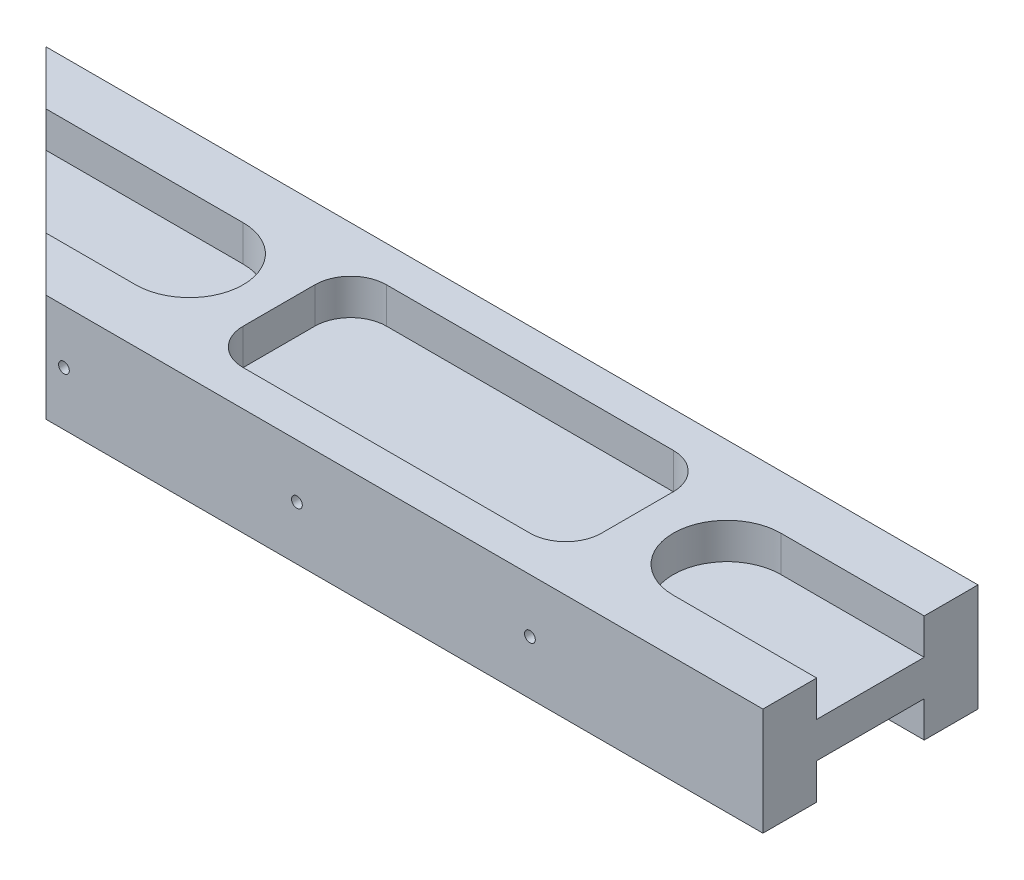
ISO-10303-21;
HEADER;
FILE_DESCRIPTION(('STEP AP214'),'2;1');
FILE_NAME('part.step','',(''),(''),'','','');
FILE_SCHEMA(('AUTOMOTIVE_DESIGN { 1 0 10303 214 1 1 1 1 }'));
ENDSEC;
DATA;
#1=APPLICATION_CONTEXT('core data for automotive mechanical design processes');
#2=APPLICATION_PROTOCOL_DEFINITION('international standard','automotive_design',2000,#1);
#3=PRODUCT_CONTEXT('',#1,'mechanical');
#4=PRODUCT('Part','Part','',(#3));
#5=PRODUCT_RELATED_PRODUCT_CATEGORY('part','',(#4));
#6=PRODUCT_DEFINITION_FORMATION('','',#4);
#7=PRODUCT_DEFINITION_CONTEXT('part definition',#1,'design');
#8=PRODUCT_DEFINITION('design','',#6,#7);
#9=PRODUCT_DEFINITION_SHAPE('','',#8);
#10=(LENGTH_UNIT() NAMED_UNIT(*) SI_UNIT(.MILLI.,.METRE.));
#11=(NAMED_UNIT(*) PLANE_ANGLE_UNIT() SI_UNIT($,.RADIAN.));
#12=(NAMED_UNIT(*) SI_UNIT($,.STERADIAN.) SOLID_ANGLE_UNIT());
#13=UNCERTAINTY_MEASURE_WITH_UNIT(LENGTH_MEASURE(1.E-05),#10,'distance_accuracy_value','');
#14=(GEOMETRIC_REPRESENTATION_CONTEXT(3) GLOBAL_UNCERTAINTY_ASSIGNED_CONTEXT((#13)) GLOBAL_UNIT_ASSIGNED_CONTEXT((#10,
#11,#12)) REPRESENTATION_CONTEXT('',''));
#15=CARTESIAN_POINT('',(0.,0.,0.));
#16=DIRECTION('',(0.,0.,1.));
#17=DIRECTION('',(1.,0.,0.));
#18=AXIS2_PLACEMENT_3D('',#15,#16,#17);
#19=CARTESIAN_POINT('',(0.,15.,-30.));
#20=DIRECTION('',(-1.,0.,0.));
#21=DIRECTION('',(0.,0.,1.));
#22=AXIS2_PLACEMENT_3D('',#19,#20,#21);
#23=PLANE('',#22);
#24=DIRECTION('',(0.,0.,-1.));
#25=VECTOR('',#24,1.);
#26=CARTESIAN_POINT('',(0.,0.,-30.));
#27=LINE('',#26,#25);
#28=CARTESIAN_POINT('',(0.,0.,0.));
#29=VERTEX_POINT('',#28);
#30=CARTESIAN_POINT('',(0.,0.,-7.50000000000001));
#31=VERTEX_POINT('',#30);
#32=EDGE_CURVE('E427',#29,#31,#27,.T.);
#33=ORIENTED_EDGE('',*,*,#32,.T.);
#34=DIRECTION('',(0.,-1.,0.));
#35=VECTOR('',#34,1.);
#36=CARTESIAN_POINT('',(0.,5.,-7.50000000000001));
#37=LINE('',#36,#35);
#38=CARTESIAN_POINT('',(0.,5.,-7.50000000000001));
#39=VERTEX_POINT('',#38);
#40=EDGE_CURVE('E334',#39,#31,#37,.T.);
#41=ORIENTED_EDGE('',*,*,#40,.F.);
#42=DIRECTION('',(0.,0.,1.));
#43=VECTOR('',#42,1.);
#44=CARTESIAN_POINT('',(0.,5.,-7.50000000000001));
#45=LINE('',#44,#43);
#46=CARTESIAN_POINT('',(0.,5.,-22.5));
#47=VERTEX_POINT('',#46);
#48=EDGE_CURVE('E319',#47,#39,#45,.T.);
#49=ORIENTED_EDGE('',*,*,#48,.F.);
#50=DIRECTION('',(0.,-1.,0.));
#51=VECTOR('',#50,1.);
#52=CARTESIAN_POINT('',(0.,5.,-22.5));
#53=LINE('',#52,#51);
#54=CARTESIAN_POINT('',(0.,0.,-22.5));
#55=VERTEX_POINT('',#54);
#56=EDGE_CURVE('E336',#47,#55,#53,.T.);
#57=ORIENTED_EDGE('',*,*,#56,.T.);
#58=CARTESIAN_POINT('',(0.,0.,-30.));
#59=VERTEX_POINT('',#58);
#60=EDGE_CURVE('E413',#55,#59,#27,.T.);
#61=ORIENTED_EDGE('',*,*,#60,.T.);
#62=DIRECTION('',(0.,-1.,0.));
#63=VECTOR('',#62,1.);
#64=CARTESIAN_POINT('',(0.,15.,-30.));
#65=LINE('',#64,#63);
#66=CARTESIAN_POINT('',(0.,15.,-30.));
#67=VERTEX_POINT('',#66);
#68=EDGE_CURVE('E446',#67,#59,#65,.T.);
#69=ORIENTED_EDGE('',*,*,#68,.F.);
#70=DIRECTION('',(0.,0.,-1.));
#71=VECTOR('',#70,1.);
#72=CARTESIAN_POINT('',(0.,15.,-30.));
#73=LINE('',#72,#71);
#74=CARTESIAN_POINT('',(0.,15.,-22.5));
#75=VERTEX_POINT('',#74);
#76=EDGE_CURVE('E418',#75,#67,#73,.T.);
#77=ORIENTED_EDGE('',*,*,#76,.F.);
#78=DIRECTION('',(0.,-1.,0.));
#79=VECTOR('',#78,1.);
#80=CARTESIAN_POINT('',(0.,15.,-22.5));
#81=LINE('',#80,#79);
#82=CARTESIAN_POINT('',(0.,10.,-22.5));
#83=VERTEX_POINT('',#82);
#84=EDGE_CURVE('E383',#75,#83,#81,.T.);
#85=ORIENTED_EDGE('',*,*,#84,.T.);
#86=DIRECTION('',(0.,0.,1.));
#87=VECTOR('',#86,1.);
#88=CARTESIAN_POINT('',(0.,10.,-30.));
#89=LINE('',#88,#87);
#90=CARTESIAN_POINT('',(0.,10.,-7.50000000000001));
#91=VERTEX_POINT('',#90);
#92=EDGE_CURVE('E11',#83,#91,#89,.T.);
#93=ORIENTED_EDGE('',*,*,#92,.T.);
#94=DIRECTION('',(0.,1.,0.));
#95=VECTOR('',#94,1.);
#96=CARTESIAN_POINT('',(0.,15.,-7.50000000000001));
#97=LINE('',#96,#95);
#98=CARTESIAN_POINT('',(0.,15.,-7.50000000000001));
#99=VERTEX_POINT('',#98);
#100=EDGE_CURVE('E404',#91,#99,#97,.T.);
#101=ORIENTED_EDGE('',*,*,#100,.T.);
#102=CARTESIAN_POINT('',(0.,15.,0.));
#103=VERTEX_POINT('',#102);
#104=EDGE_CURVE('E414',#103,#99,#73,.T.);
#105=ORIENTED_EDGE('',*,*,#104,.F.);
#106=DIRECTION('',(0.,-1.,0.));
#107=VECTOR('',#106,1.);
#108=CARTESIAN_POINT('',(0.,15.,0.));
#109=LINE('',#108,#107);
#110=EDGE_CURVE('E426',#103,#29,#109,.T.);
#111=ORIENTED_EDGE('',*,*,#110,.T.);
#112=EDGE_LOOP('',(#33,#41,#49,#57,#61,#69,#77,#85,#93,#101,#105,#111));
#113=FACE_BOUND('',#112,.T.);
#114=ADVANCED_FACE('F39',(#113),#23,.F.);
#115=CARTESIAN_POINT('',(-130.,15.,-30.));
#116=DIRECTION('',(0.,0.,1.));
#117=DIRECTION('',(1.,0.,0.));
#118=AXIS2_PLACEMENT_3D('',#115,#116,#117);
#119=PLANE('',#118);
#120=CARTESIAN_POINT('',(-97.5,7.5,-30.));
#121=DIRECTION('',(0.,0.,-1.));
#122=DIRECTION('',(-1.,0.,0.));
#123=AXIS2_PLACEMENT_3D('',#120,#121,#122);
#124=CIRCLE('',#123,0.749999999999999);
#125=CARTESIAN_POINT('',(-98.25,7.5,-30.));
#126=VERTEX_POINT('',#125);
#127=EDGE_CURVE('E298',#126,#126,#124,.T.);
#128=ORIENTED_EDGE('',*,*,#127,.F.);
#129=EDGE_LOOP('',(#128));
#130=FACE_BOUND('',#129,.T.);
#131=CARTESIAN_POINT('',(-32.5,7.5,-30.));
#132=DIRECTION('',(0.,0.,-1.));
#133=DIRECTION('',(-1.,0.,0.));
#134=AXIS2_PLACEMENT_3D('',#131,#132,#133);
#135=CIRCLE('',#134,0.749999999999999);
#136=CARTESIAN_POINT('',(-33.25,7.5,-30.));
#137=VERTEX_POINT('',#136);
#138=EDGE_CURVE('E297',#137,#137,#135,.T.);
#139=ORIENTED_EDGE('',*,*,#138,.F.);
#140=EDGE_LOOP('',(#139));
#141=FACE_BOUND('',#140,.T.);
#142=CARTESIAN_POINT('',(-65.,7.5,-30.));
#143=DIRECTION('',(0.,0.,-1.));
#144=DIRECTION('',(-1.,0.,0.));
#145=AXIS2_PLACEMENT_3D('',#142,#143,#144);
#146=CIRCLE('',#145,0.749999999999999);
#147=CARTESIAN_POINT('',(-65.75,7.5,-30.));
#148=VERTEX_POINT('',#147);
#149=EDGE_CURVE('E301',#148,#148,#146,.T.);
#150=ORIENTED_EDGE('',*,*,#149,.F.);
#151=EDGE_LOOP('',(#150));
#152=FACE_BOUND('',#151,.T.);
#153=DIRECTION('',(-1.,0.,0.));
#154=VECTOR('',#153,1.);
#155=CARTESIAN_POINT('',(-130.,0.,-30.));
#156=LINE('',#155,#154);
#157=CARTESIAN_POINT('',(-130.,0.,-30.));
#158=VERTEX_POINT('',#157);
#159=EDGE_CURVE('E430',#59,#158,#156,.T.);
#160=ORIENTED_EDGE('',*,*,#159,.T.);
#161=DIRECTION('',(0.,-1.,0.));
#162=VECTOR('',#161,1.);
#163=CARTESIAN_POINT('',(-130.,15.,-30.));
#164=LINE('',#163,#162);
#165=CARTESIAN_POINT('',(-130.,15.,-30.));
#166=VERTEX_POINT('',#165);
#167=EDGE_CURVE('E443',#166,#158,#164,.T.);
#168=ORIENTED_EDGE('',*,*,#167,.F.);
#169=DIRECTION('',(-1.,0.,0.));
#170=VECTOR('',#169,1.);
#171=CARTESIAN_POINT('',(-130.,15.,-30.));
#172=LINE('',#171,#170);
#173=EDGE_CURVE('E417',#67,#166,#172,.T.);
#174=ORIENTED_EDGE('',*,*,#173,.F.);
#175=ORIENTED_EDGE('',*,*,#68,.T.);
#176=EDGE_LOOP('',(#160,#168,#174,#175));
#177=FACE_BOUND('',#176,.T.);
#178=ADVANCED_FACE('F483',(#130,#141,#152,#177),#119,.F.);
#179=CARTESIAN_POINT('',(-100.,15.,0.));
#180=DIRECTION('',(0.707106781186547,0.,-0.707106781186547));
#181=DIRECTION('',(-0.707106781186548,0.,-0.707106781186548));
#182=AXIS2_PLACEMENT_3D('',#179,#180,#181);
#183=PLANE('',#182);
#184=DIRECTION('',(0.707106781186547,0.,0.707106781186547));
#185=VECTOR('',#184,1.);
#186=CARTESIAN_POINT('',(-100.,0.,0.));
#187=LINE('',#186,#185);
#188=CARTESIAN_POINT('',(-122.5,0.,-22.5));
#189=VERTEX_POINT('',#188);
#190=EDGE_CURVE('E433',#158,#189,#187,.T.);
#191=ORIENTED_EDGE('',*,*,#190,.T.);
#192=DIRECTION('',(0.,-1.,0.));
#193=VECTOR('',#192,1.);
#194=CARTESIAN_POINT('',(-122.5,5.,-22.5));
#195=LINE('',#194,#193);
#196=CARTESIAN_POINT('',(-122.5,5.,-22.5));
#197=VERTEX_POINT('',#196);
#198=EDGE_CURVE('E347',#197,#189,#195,.T.);
#199=ORIENTED_EDGE('',*,*,#198,.F.);
#200=DIRECTION('',(-0.707106781186547,0.,-0.707106781186547));
#201=VECTOR('',#200,1.);
#202=CARTESIAN_POINT('',(-122.5,5.,-22.5));
#203=LINE('',#202,#201);
#204=CARTESIAN_POINT('',(-107.5,5.,-7.50000000000001));
#205=VERTEX_POINT('',#204);
#206=EDGE_CURVE('E359',#205,#197,#203,.T.);
#207=ORIENTED_EDGE('',*,*,#206,.F.);
#208=DIRECTION('',(0.,-1.,0.));
#209=VECTOR('',#208,1.);
#210=CARTESIAN_POINT('',(-107.5,5.,-7.50000000000001));
#211=LINE('',#210,#209);
#212=CARTESIAN_POINT('',(-107.5,0.,-7.50000000000001));
#213=VERTEX_POINT('',#212);
#214=EDGE_CURVE('E344',#205,#213,#211,.T.);
#215=ORIENTED_EDGE('',*,*,#214,.T.);
#216=CARTESIAN_POINT('',(-100.,0.,0.));
#217=VERTEX_POINT('',#216);
#218=EDGE_CURVE('E432',#213,#217,#187,.T.);
#219=ORIENTED_EDGE('',*,*,#218,.T.);
#220=DIRECTION('',(0.,-1.,0.));
#221=VECTOR('',#220,1.);
#222=CARTESIAN_POINT('',(-100.,15.,0.));
#223=LINE('',#222,#221);
#224=CARTESIAN_POINT('',(-100.,15.,0.));
#225=VERTEX_POINT('',#224);
#226=EDGE_CURVE('E440',#225,#217,#223,.T.);
#227=ORIENTED_EDGE('',*,*,#226,.F.);
#228=DIRECTION('',(0.707106781186547,0.,0.707106781186547));
#229=VECTOR('',#228,1.);
#230=CARTESIAN_POINT('',(-100.,15.,0.));
#231=LINE('',#230,#229);
#232=CARTESIAN_POINT('',(-107.5,15.,-7.50000000000001));
#233=VERTEX_POINT('',#232);
#234=EDGE_CURVE('E420',#233,#225,#231,.T.);
#235=ORIENTED_EDGE('',*,*,#234,.F.);
#236=DIRECTION('',(0.,-1.,0.));
#237=VECTOR('',#236,1.);
#238=CARTESIAN_POINT('',(-107.5,15.,-7.50000000000001));
#239=LINE('',#238,#237);
#240=CARTESIAN_POINT('',(-107.5,10.,-7.50000000000001));
#241=VERTEX_POINT('',#240);
#242=EDGE_CURVE('E407',#233,#241,#239,.T.);
#243=ORIENTED_EDGE('',*,*,#242,.T.);
#244=DIRECTION('',(0.707106781186548,0.,0.707106781186548));
#245=VECTOR('',#244,1.);
#246=CARTESIAN_POINT('',(-100.,10.,0.));
#247=LINE('',#246,#245);
#248=CARTESIAN_POINT('',(-122.5,10.,-22.5));
#249=VERTEX_POINT('',#248);
#250=EDGE_CURVE('E46',#249,#241,#247,.T.);
#251=ORIENTED_EDGE('',*,*,#250,.F.);
#252=DIRECTION('',(0.,1.,0.));
#253=VECTOR('',#252,1.);
#254=CARTESIAN_POINT('',(-122.5,15.,-22.5));
#255=LINE('',#254,#253);
#256=CARTESIAN_POINT('',(-122.5,15.,-22.5));
#257=VERTEX_POINT('',#256);
#258=EDGE_CURVE('E410',#249,#257,#255,.T.);
#259=ORIENTED_EDGE('',*,*,#258,.T.);
#260=EDGE_CURVE('E421',#166,#257,#231,.T.);
#261=ORIENTED_EDGE('',*,*,#260,.F.);
#262=ORIENTED_EDGE('',*,*,#167,.T.);
#263=EDGE_LOOP('',(#191,#199,#207,#215,#219,#227,#235,#243,#251,#259,#261,#262));
#264=FACE_BOUND('',#263,.T.);
#265=ADVANCED_FACE('F465',(#264),#183,.F.);
#266=CARTESIAN_POINT('',(0.,15.,0.));
#267=DIRECTION('',(0.,0.,-1.));
#268=DIRECTION('',(-1.,0.,0.));
#269=AXIS2_PLACEMENT_3D('',#266,#267,#268);
#270=PLANE('',#269);
#271=CARTESIAN_POINT('',(-97.5,7.5,0.));
#272=DIRECTION('',(0.,0.,-1.));
#273=DIRECTION('',(-1.,0.,0.));
#274=AXIS2_PLACEMENT_3D('',#271,#272,#273);
#275=CIRCLE('',#274,0.749999999999999);
#276=CARTESIAN_POINT('',(-98.25,7.5,0.));
#277=VERTEX_POINT('',#276);
#278=EDGE_CURVE('E282',#277,#277,#275,.F.);
#279=ORIENTED_EDGE('',*,*,#278,.F.);
#280=EDGE_LOOP('',(#279));
#281=FACE_BOUND('',#280,.T.);
#282=CARTESIAN_POINT('',(-32.5,7.5,0.));
#283=DIRECTION('',(0.,0.,-1.));
#284=DIRECTION('',(-1.,0.,0.));
#285=AXIS2_PLACEMENT_3D('',#282,#283,#284);
#286=CIRCLE('',#285,0.749999999999999);
#287=CARTESIAN_POINT('',(-33.25,7.5,0.));
#288=VERTEX_POINT('',#287);
#289=EDGE_CURVE('E294',#288,#288,#286,.F.);
#290=ORIENTED_EDGE('',*,*,#289,.F.);
#291=EDGE_LOOP('',(#290));
#292=FACE_BOUND('',#291,.T.);
#293=CARTESIAN_POINT('',(-65.,7.5,0.));
#294=DIRECTION('',(0.,0.,-1.));
#295=DIRECTION('',(-1.,0.,0.));
#296=AXIS2_PLACEMENT_3D('',#293,#294,#295);
#297=CIRCLE('',#296,0.749999999999999);
#298=CARTESIAN_POINT('',(-65.75,7.5,0.));
#299=VERTEX_POINT('',#298);
#300=EDGE_CURVE('E308',#299,#299,#297,.F.);
#301=ORIENTED_EDGE('',*,*,#300,.F.);
#302=EDGE_LOOP('',(#301));
#303=FACE_BOUND('',#302,.T.);
#304=DIRECTION('',(1.,0.,0.));
#305=VECTOR('',#304,1.);
#306=CARTESIAN_POINT('',(0.,0.,0.));
#307=LINE('',#306,#305);
#308=EDGE_CURVE('E436',#217,#29,#307,.T.);
#309=ORIENTED_EDGE('',*,*,#308,.T.);
#310=ORIENTED_EDGE('',*,*,#110,.F.);
#311=DIRECTION('',(1.,0.,0.));
#312=VECTOR('',#311,1.);
#313=CARTESIAN_POINT('',(0.,15.,0.));
#314=LINE('',#313,#312);
#315=EDGE_CURVE('E424',#225,#103,#314,.T.);
#316=ORIENTED_EDGE('',*,*,#315,.F.);
#317=ORIENTED_EDGE('',*,*,#226,.T.);
#318=EDGE_LOOP('',(#309,#310,#316,#317));
#319=FACE_BOUND('',#318,.T.);
#320=ADVANCED_FACE('F508',(#281,#292,#303,#319),#270,.F.);
#321=CARTESIAN_POINT('',(0.,15.,0.));
#322=DIRECTION('',(0.,-1.,0.));
#323=DIRECTION('',(0.,0.,-1.));
#324=AXIS2_PLACEMENT_3D('',#321,#322,#323);
#325=PLANE('',#324);
#326=DIRECTION('',(-1.,0.,0.));
#327=VECTOR('',#326,1.);
#328=CARTESIAN_POINT('',(-77.5,15.,-25.));
#329=LINE('',#328,#327);
#330=CARTESIAN_POINT('',(-37.5,15.,-25.));
#331=VERTEX_POINT('',#330);
#332=CARTESIAN_POINT('',(-77.5,15.,-25.));
#333=VERTEX_POINT('',#332);
#334=EDGE_CURVE('E264',#331,#333,#329,.T.);
#335=ORIENTED_EDGE('',*,*,#334,.F.);
#336=CARTESIAN_POINT('',(-37.5,15.,-20.));
#337=DIRECTION('',(0.,1.,0.));
#338=DIRECTION('',(0.,0.,-1.));
#339=AXIS2_PLACEMENT_3D('',#336,#337,#338);
#340=CIRCLE('',#339,5.);
#341=CARTESIAN_POINT('',(-32.5,15.,-20.));
#342=VERTEX_POINT('',#341);
#343=EDGE_CURVE('E53',#342,#331,#340,.T.);
#344=ORIENTED_EDGE('',*,*,#343,.F.);
#345=DIRECTION('',(0.,0.,-1.));
#346=VECTOR('',#345,1.);
#347=CARTESIAN_POINT('',(-32.5,15.,-20.));
#348=LINE('',#347,#346);
#349=CARTESIAN_POINT('',(-32.5,15.,-10.));
#350=VERTEX_POINT('',#349);
#351=EDGE_CURVE('E244',#350,#342,#348,.T.);
#352=ORIENTED_EDGE('',*,*,#351,.F.);
#353=CARTESIAN_POINT('',(-37.5,15.,-10.));
#354=DIRECTION('',(0.,1.,0.));
#355=DIRECTION('',(0.,0.,1.));
#356=AXIS2_PLACEMENT_3D('',#353,#354,#355);
#357=CIRCLE('',#356,5.);
#358=CARTESIAN_POINT('',(-37.5,15.,-5.));
#359=VERTEX_POINT('',#358);
#360=EDGE_CURVE('E247',#359,#350,#357,.T.);
#361=ORIENTED_EDGE('',*,*,#360,.F.);
#362=DIRECTION('',(1.,0.,0.));
#363=VECTOR('',#362,1.);
#364=CARTESIAN_POINT('',(-77.5,15.,-5.));
#365=LINE('',#364,#363);
#366=CARTESIAN_POINT('',(-77.5,15.,-5.));
#367=VERTEX_POINT('',#366);
#368=EDGE_CURVE('E275',#367,#359,#365,.T.);
#369=ORIENTED_EDGE('',*,*,#368,.F.);
#370=CARTESIAN_POINT('',(-77.5,15.,-10.));
#371=DIRECTION('',(0.,1.,0.));
#372=DIRECTION('',(0.,0.,1.));
#373=AXIS2_PLACEMENT_3D('',#370,#371,#372);
#374=CIRCLE('',#373,5.);
#375=CARTESIAN_POINT('',(-82.5,15.,-10.));
#376=VERTEX_POINT('',#375);
#377=EDGE_CURVE('E272',#376,#367,#374,.T.);
#378=ORIENTED_EDGE('',*,*,#377,.F.);
#379=DIRECTION('',(0.,0.,1.));
#380=VECTOR('',#379,1.);
#381=CARTESIAN_POINT('',(-82.5,15.,-20.));
#382=LINE('',#381,#380);
#383=CARTESIAN_POINT('',(-82.5,15.,-20.));
#384=VERTEX_POINT('',#383);
#385=EDGE_CURVE('E269',#384,#376,#382,.T.);
#386=ORIENTED_EDGE('',*,*,#385,.F.);
#387=CARTESIAN_POINT('',(-77.5,15.,-20.));
#388=DIRECTION('',(0.,1.,0.));
#389=DIRECTION('',(0.,0.,1.));
#390=AXIS2_PLACEMENT_3D('',#387,#388,#389);
#391=CIRCLE('',#390,5.);
#392=EDGE_CURVE('E266',#333,#384,#391,.T.);
#393=ORIENTED_EDGE('',*,*,#392,.F.);
#394=EDGE_LOOP('',(#335,#344,#352,#361,#369,#378,#386,#393));
#395=FACE_BOUND('',#394,.T.);
#396=ORIENTED_EDGE('',*,*,#260,.T.);
#397=DIRECTION('',(-1.,0.,0.));
#398=VECTOR('',#397,1.);
#399=CARTESIAN_POINT('',(-135.,15.,-22.5));
#400=LINE('',#399,#398);
#401=CARTESIAN_POINT('',(-95.,15.,-22.5));
#402=VERTEX_POINT('',#401);
#403=EDGE_CURVE('E369',#402,#257,#400,.T.);
#404=ORIENTED_EDGE('',*,*,#403,.F.);
#405=CARTESIAN_POINT('',(-95.,15.,-15.));
#406=DIRECTION('',(0.,1.,0.));
#407=DIRECTION('',(0.,0.,1.));
#408=AXIS2_PLACEMENT_3D('',#405,#406,#407);
#409=CIRCLE('',#408,7.5);
#410=CARTESIAN_POINT('',(-95.,15.,-7.50000000000001));
#411=VERTEX_POINT('',#410);
#412=EDGE_CURVE('E376',#411,#402,#409,.T.);
#413=ORIENTED_EDGE('',*,*,#412,.F.);
#414=DIRECTION('',(-1.,0.,0.));
#415=VECTOR('',#414,1.);
#416=CARTESIAN_POINT('',(0.,15.,-7.50000000000002));
#417=LINE('',#416,#415);
#418=EDGE_CURVE('E452',#411,#233,#417,.T.);
#419=ORIENTED_EDGE('',*,*,#418,.T.);
#420=ORIENTED_EDGE('',*,*,#234,.T.);
#421=ORIENTED_EDGE('',*,*,#315,.T.);
#422=ORIENTED_EDGE('',*,*,#104,.T.);
#423=DIRECTION('',(1.,0.,0.));
#424=VECTOR('',#423,1.);
#425=CARTESIAN_POINT('',(20.,15.,-7.5));
#426=LINE('',#425,#424);
#427=CARTESIAN_POINT('',(-20.,15.,-7.50000000000001));
#428=VERTEX_POINT('',#427);
#429=EDGE_CURVE('E391',#428,#99,#426,.T.);
#430=ORIENTED_EDGE('',*,*,#429,.F.);
#431=CARTESIAN_POINT('',(-20.,15.,-15.));
#432=DIRECTION('',(0.,1.,0.));
#433=DIRECTION('',(0.,0.,-1.));
#434=AXIS2_PLACEMENT_3D('',#431,#432,#433);
#435=CIRCLE('',#434,7.5);
#436=CARTESIAN_POINT('',(-20.,15.,-22.5));
#437=VERTEX_POINT('',#436);
#438=EDGE_CURVE('E379',#437,#428,#435,.T.);
#439=ORIENTED_EDGE('',*,*,#438,.F.);
#440=DIRECTION('',(1.,0.,0.));
#441=VECTOR('',#440,1.);
#442=CARTESIAN_POINT('',(0.,15.,-22.5));
#443=LINE('',#442,#441);
#444=EDGE_CURVE('E449',#437,#75,#443,.T.);
#445=ORIENTED_EDGE('',*,*,#444,.T.);
#446=ORIENTED_EDGE('',*,*,#76,.T.);
#447=ORIENTED_EDGE('',*,*,#173,.T.);
#448=EDGE_LOOP('',(#396,#404,#413,#419,#420,#421,#422,#430,#439,#445,#446,#447));
#449=FACE_BOUND('',#448,.T.);
#450=ADVANCED_FACE('F469',(#395,#449),#325,.F.);
#451=CARTESIAN_POINT('',(0.,0.,0.));
#452=DIRECTION('',(0.,-1.,0.));
#453=DIRECTION('',(0.,0.,-1.));
#454=AXIS2_PLACEMENT_3D('',#451,#452,#453);
#455=PLANE('',#454);
#456=DIRECTION('',(-1.,0.,0.));
#457=VECTOR('',#456,1.);
#458=CARTESIAN_POINT('',(-20.,0.,-7.50000000000001));
#459=LINE('',#458,#457);
#460=CARTESIAN_POINT('',(-20.,0.,-7.50000000000001));
#461=VERTEX_POINT('',#460);
#462=EDGE_CURVE('E316',#31,#461,#459,.T.);
#463=ORIENTED_EDGE('',*,*,#462,.F.);
#464=ORIENTED_EDGE('',*,*,#32,.F.);
#465=ORIENTED_EDGE('',*,*,#308,.F.);
#466=ORIENTED_EDGE('',*,*,#218,.F.);
#467=DIRECTION('',(-1.,0.,0.));
#468=VECTOR('',#467,1.);
#469=CARTESIAN_POINT('',(-107.5,0.,-7.50000000000001));
#470=LINE('',#469,#468);
#471=CARTESIAN_POINT('',(-95.,0.,-7.50000000000001));
#472=VERTEX_POINT('',#471);
#473=EDGE_CURVE('E353',#472,#213,#470,.T.);
#474=ORIENTED_EDGE('',*,*,#473,.F.);
#475=CARTESIAN_POINT('',(-95.,0.,-15.));
#476=DIRECTION('',(0.,-1.,0.));
#477=DIRECTION('',(0.,0.,-1.));
#478=AXIS2_PLACEMENT_3D('',#475,#476,#477);
#479=CIRCLE('',#478,7.5);
#480=CARTESIAN_POINT('',(-95.,0.,-22.5));
#481=VERTEX_POINT('',#480);
#482=EDGE_CURVE('E327',#481,#472,#479,.T.);
#483=ORIENTED_EDGE('',*,*,#482,.F.);
#484=DIRECTION('',(1.,0.,0.));
#485=VECTOR('',#484,1.);
#486=CARTESIAN_POINT('',(-95.,0.,-22.5));
#487=LINE('',#486,#485);
#488=EDGE_CURVE('E350',#189,#481,#487,.T.);
#489=ORIENTED_EDGE('',*,*,#488,.F.);
#490=ORIENTED_EDGE('',*,*,#190,.F.);
#491=ORIENTED_EDGE('',*,*,#159,.F.);
#492=ORIENTED_EDGE('',*,*,#60,.F.);
#493=DIRECTION('',(1.,0.,0.));
#494=VECTOR('',#493,1.);
#495=CARTESIAN_POINT('',(0.,0.,-22.5));
#496=LINE('',#495,#494);
#497=CARTESIAN_POINT('',(-20.,0.,-22.5));
#498=VERTEX_POINT('',#497);
#499=EDGE_CURVE('E326',#498,#55,#496,.T.);
#500=ORIENTED_EDGE('',*,*,#499,.F.);
#501=CARTESIAN_POINT('',(-20.,0.,-15.));
#502=DIRECTION('',(0.,-1.,0.));
#503=DIRECTION('',(0.,0.,-1.));
#504=AXIS2_PLACEMENT_3D('',#501,#502,#503);
#505=CIRCLE('',#504,7.5);
#506=EDGE_CURVE('E61',#461,#498,#505,.T.);
#507=ORIENTED_EDGE('',*,*,#506,.F.);
#508=EDGE_LOOP('',(#463,#464,#465,#466,#474,#483,#489,#490,#491,#492,#500,#507));
#509=FACE_BOUND('',#508,.T.);
#510=ADVANCED_FACE('F490',(#509),#455,.T.);
#511=CARTESIAN_POINT('',(20.,10.,-15.));
#512=DIRECTION('',(0.,-1.,0.));
#513=DIRECTION('',(0.,0.,-1.));
#514=AXIS2_PLACEMENT_3D('',#511,#512,#513);
#515=PLANE('',#514);
#516=DIRECTION('',(-1.,0.,0.));
#517=VECTOR('',#516,1.);
#518=CARTESIAN_POINT('',(20.,10.,-22.5));
#519=LINE('',#518,#517);
#520=CARTESIAN_POINT('',(-20.,10.,-22.5));
#521=VERTEX_POINT('',#520);
#522=EDGE_CURVE('E393',#83,#521,#519,.T.);
#523=ORIENTED_EDGE('',*,*,#522,.T.);
#524=CARTESIAN_POINT('',(-20.,10.,-15.));
#525=DIRECTION('',(0.,1.,0.));
#526=DIRECTION('',(0.,0.,-1.));
#527=AXIS2_PLACEMENT_3D('',#524,#525,#526);
#528=CIRCLE('',#527,7.5);
#529=CARTESIAN_POINT('',(-20.,10.,-7.50000000000001));
#530=VERTEX_POINT('',#529);
#531=EDGE_CURVE('E398',#521,#530,#528,.T.);
#532=ORIENTED_EDGE('',*,*,#531,.T.);
#533=DIRECTION('',(1.,0.,0.));
#534=VECTOR('',#533,1.);
#535=CARTESIAN_POINT('',(20.,10.,-7.5));
#536=LINE('',#535,#534);
#537=EDGE_CURVE('E389',#530,#91,#536,.T.);
#538=ORIENTED_EDGE('',*,*,#537,.T.);
#539=ORIENTED_EDGE('',*,*,#92,.F.);
#540=EDGE_LOOP('',(#523,#532,#538,#539));
#541=FACE_BOUND('',#540,.T.);
#542=ADVANCED_FACE('F564',(#541),#515,.F.);
#543=CARTESIAN_POINT('',(20.,10.,-7.5));
#544=DIRECTION('',(0.,0.,1.));
#545=DIRECTION('',(1.,0.,0.));
#546=AXIS2_PLACEMENT_3D('',#543,#544,#545);
#547=PLANE('',#546);
#548=ORIENTED_EDGE('',*,*,#537,.F.);
#549=DIRECTION('',(0.,1.,0.));
#550=VECTOR('',#549,1.);
#551=CARTESIAN_POINT('',(-20.,10.,-7.50000000000001));
#552=LINE('',#551,#550);
#553=EDGE_CURVE('E333',#530,#428,#552,.T.);
#554=ORIENTED_EDGE('',*,*,#553,.T.);
#555=ORIENTED_EDGE('',*,*,#429,.T.);
#556=ORIENTED_EDGE('',*,*,#100,.F.);
#557=EDGE_LOOP('',(#548,#554,#555,#556));
#558=FACE_BOUND('',#557,.T.);
#559=ADVANCED_FACE('F515',(#558),#547,.F.);
#560=CARTESIAN_POINT('',(20.,10.,-22.5));
#561=DIRECTION('',(0.,0.,-1.));
#562=DIRECTION('',(-1.,0.,0.));
#563=AXIS2_PLACEMENT_3D('',#560,#561,#562);
#564=PLANE('',#563);
#565=ORIENTED_EDGE('',*,*,#444,.F.);
#566=DIRECTION('',(0.,1.,0.));
#567=VECTOR('',#566,1.);
#568=CARTESIAN_POINT('',(-20.,10.,-22.5));
#569=LINE('',#568,#567);
#570=EDGE_CURVE('E386',#521,#437,#569,.T.);
#571=ORIENTED_EDGE('',*,*,#570,.F.);
#572=ORIENTED_EDGE('',*,*,#522,.F.);
#573=ORIENTED_EDGE('',*,*,#84,.F.);
#574=EDGE_LOOP('',(#565,#571,#572,#573));
#575=FACE_BOUND('',#574,.T.);
#576=ADVANCED_FACE('F522',(#575),#564,.F.);
#577=CARTESIAN_POINT('',(-20.,10.,-15.));
#578=DIRECTION('',(0.,1.,0.));
#579=DIRECTION('',(0.,0.,1.));
#580=AXIS2_PLACEMENT_3D('',#577,#578,#579);
#581=CYLINDRICAL_SURFACE('',#580,7.5);
#582=ORIENTED_EDGE('',*,*,#438,.T.);
#583=ORIENTED_EDGE('',*,*,#553,.F.);
#584=ORIENTED_EDGE('',*,*,#531,.F.);
#585=ORIENTED_EDGE('',*,*,#570,.T.);
#586=EDGE_LOOP('',(#582,#583,#584,#585));
#587=FACE_BOUND('',#586,.T.);
#588=ADVANCED_FACE('F518',(#587),#581,.F.);
#589=CARTESIAN_POINT('',(-135.,10.,-15.));
#590=DIRECTION('',(0.,1.,0.));
#591=DIRECTION('',(0.,0.,1.));
#592=AXIS2_PLACEMENT_3D('',#589,#590,#591);
#593=PLANE('',#592);
#594=ORIENTED_EDGE('',*,*,#250,.T.);
#595=DIRECTION('',(1.,0.,0.));
#596=VECTOR('',#595,1.);
#597=CARTESIAN_POINT('',(-135.,10.,-7.5));
#598=LINE('',#597,#596);
#599=CARTESIAN_POINT('',(-95.,10.,-7.50000000000001));
#600=VERTEX_POINT('',#599);
#601=EDGE_CURVE('E366',#241,#600,#598,.T.);
#602=ORIENTED_EDGE('',*,*,#601,.T.);
#603=CARTESIAN_POINT('',(-95.,10.,-15.));
#604=DIRECTION('',(0.,1.,0.));
#605=DIRECTION('',(0.,0.,1.));
#606=AXIS2_PLACEMENT_3D('',#603,#604,#605);
#607=CIRCLE('',#606,7.5);
#608=CARTESIAN_POINT('',(-95.,10.,-22.5));
#609=VERTEX_POINT('',#608);
#610=EDGE_CURVE('E368',#600,#609,#607,.T.);
#611=ORIENTED_EDGE('',*,*,#610,.T.);
#612=DIRECTION('',(-1.,0.,0.));
#613=VECTOR('',#612,1.);
#614=CARTESIAN_POINT('',(-135.,10.,-22.5));
#615=LINE('',#614,#613);
#616=EDGE_CURVE('E372',#609,#249,#615,.T.);
#617=ORIENTED_EDGE('',*,*,#616,.T.);
#618=EDGE_LOOP('',(#594,#602,#611,#617));
#619=FACE_BOUND('',#618,.T.);
#620=ADVANCED_FACE('F457',(#619),#593,.T.);
#621=CARTESIAN_POINT('',(-135.,10.,-22.5));
#622=DIRECTION('',(0.,0.,-1.));
#623=DIRECTION('',(-1.,0.,0.));
#624=AXIS2_PLACEMENT_3D('',#621,#622,#623);
#625=PLANE('',#624);
#626=ORIENTED_EDGE('',*,*,#616,.F.);
#627=DIRECTION('',(0.,1.,0.));
#628=VECTOR('',#627,1.);
#629=CARTESIAN_POINT('',(-95.,10.,-22.5));
#630=LINE('',#629,#628);
#631=EDGE_CURVE('E381',#609,#402,#630,.T.);
#632=ORIENTED_EDGE('',*,*,#631,.T.);
#633=ORIENTED_EDGE('',*,*,#403,.T.);
#634=ORIENTED_EDGE('',*,*,#258,.F.);
#635=EDGE_LOOP('',(#626,#632,#633,#634));
#636=FACE_BOUND('',#635,.T.);
#637=ADVANCED_FACE('F476',(#636),#625,.F.);
#638=CARTESIAN_POINT('',(-135.,10.,-7.5));
#639=DIRECTION('',(0.,0.,1.));
#640=DIRECTION('',(1.,0.,0.));
#641=AXIS2_PLACEMENT_3D('',#638,#639,#640);
#642=PLANE('',#641);
#643=ORIENTED_EDGE('',*,*,#418,.F.);
#644=DIRECTION('',(0.,1.,0.));
#645=VECTOR('',#644,1.);
#646=CARTESIAN_POINT('',(-95.,10.,-7.50000000000001));
#647=LINE('',#646,#645);
#648=EDGE_CURVE('E375',#600,#411,#647,.T.);
#649=ORIENTED_EDGE('',*,*,#648,.F.);
#650=ORIENTED_EDGE('',*,*,#601,.F.);
#651=ORIENTED_EDGE('',*,*,#242,.F.);
#652=EDGE_LOOP('',(#643,#649,#650,#651));
#653=FACE_BOUND('',#652,.T.);
#654=ADVANCED_FACE('F462',(#653),#642,.F.);
#655=CARTESIAN_POINT('',(-95.,10.,-15.));
#656=DIRECTION('',(0.,1.,0.));
#657=DIRECTION('',(0.,0.,1.));
#658=AXIS2_PLACEMENT_3D('',#655,#656,#657);
#659=CYLINDRICAL_SURFACE('',#658,7.5);
#660=ORIENTED_EDGE('',*,*,#412,.T.);
#661=ORIENTED_EDGE('',*,*,#631,.F.);
#662=ORIENTED_EDGE('',*,*,#610,.F.);
#663=ORIENTED_EDGE('',*,*,#648,.T.);
#664=EDGE_LOOP('',(#660,#661,#662,#663));
#665=FACE_BOUND('',#664,.T.);
#666=ADVANCED_FACE('F474',(#665),#659,.F.);
#667=CARTESIAN_POINT('',(-95.,5.,-15.));
#668=DIRECTION('',(0.,-1.,0.));
#669=DIRECTION('',(0.,0.,-1.));
#670=AXIS2_PLACEMENT_3D('',#667,#668,#669);
#671=CYLINDRICAL_SURFACE('',#670,7.5);
#672=ORIENTED_EDGE('',*,*,#482,.T.);
#673=DIRECTION('',(0.,-1.,0.));
#674=VECTOR('',#673,1.);
#675=CARTESIAN_POINT('',(-95.,5.,-7.50000000000001));
#676=LINE('',#675,#674);
#677=CARTESIAN_POINT('',(-95.,5.,-7.50000000000001));
#678=VERTEX_POINT('',#677);
#679=EDGE_CURVE('E340',#678,#472,#676,.T.);
#680=ORIENTED_EDGE('',*,*,#679,.F.);
#681=CARTESIAN_POINT('',(-95.,5.,-15.));
#682=DIRECTION('',(0.,-1.,0.));
#683=DIRECTION('',(0.,0.,-1.));
#684=AXIS2_PLACEMENT_3D('',#681,#682,#683);
#685=CIRCLE('',#684,7.5);
#686=CARTESIAN_POINT('',(-95.,5.,-22.5));
#687=VERTEX_POINT('',#686);
#688=EDGE_CURVE('E354',#687,#678,#685,.T.);
#689=ORIENTED_EDGE('',*,*,#688,.F.);
#690=DIRECTION('',(0.,-1.,0.));
#691=VECTOR('',#690,1.);
#692=CARTESIAN_POINT('',(-95.,5.,-22.5));
#693=LINE('',#692,#691);
#694=EDGE_CURVE('E311',#687,#481,#693,.T.);
#695=ORIENTED_EDGE('',*,*,#694,.T.);
#696=EDGE_LOOP('',(#672,#680,#689,#695));
#697=FACE_BOUND('',#696,.T.);
#698=ADVANCED_FACE('F580',(#697),#671,.F.);
#699=CARTESIAN_POINT('',(-95.,5.,-22.5));
#700=DIRECTION('',(0.,0.,-1.));
#701=DIRECTION('',(-1.,0.,0.));
#702=AXIS2_PLACEMENT_3D('',#699,#700,#701);
#703=PLANE('',#702);
#704=ORIENTED_EDGE('',*,*,#488,.T.);
#705=ORIENTED_EDGE('',*,*,#694,.F.);
#706=DIRECTION('',(1.,0.,0.));
#707=VECTOR('',#706,1.);
#708=CARTESIAN_POINT('',(-95.,5.,-22.5));
#709=LINE('',#708,#707);
#710=EDGE_CURVE('E343',#197,#687,#709,.T.);
#711=ORIENTED_EDGE('',*,*,#710,.F.);
#712=ORIENTED_EDGE('',*,*,#198,.T.);
#713=EDGE_LOOP('',(#704,#705,#711,#712));
#714=FACE_BOUND('',#713,.T.);
#715=ADVANCED_FACE('F495',(#714),#703,.F.);
#716=CARTESIAN_POINT('',(-107.5,5.,-7.50000000000001));
#717=DIRECTION('',(0.,0.,1.));
#718=DIRECTION('',(1.,0.,0.));
#719=AXIS2_PLACEMENT_3D('',#716,#717,#718);
#720=PLANE('',#719);
#721=ORIENTED_EDGE('',*,*,#473,.T.);
#722=ORIENTED_EDGE('',*,*,#214,.F.);
#723=DIRECTION('',(-1.,0.,0.));
#724=VECTOR('',#723,1.);
#725=CARTESIAN_POINT('',(-107.5,5.,-7.50000000000001));
#726=LINE('',#725,#724);
#727=EDGE_CURVE('E361',#678,#205,#726,.T.);
#728=ORIENTED_EDGE('',*,*,#727,.F.);
#729=ORIENTED_EDGE('',*,*,#679,.T.);
#730=EDGE_LOOP('',(#721,#722,#728,#729));
#731=FACE_BOUND('',#730,.T.);
#732=ADVANCED_FACE('F504',(#731),#720,.F.);
#733=CARTESIAN_POINT('',(-95.,5.,-15.));
#734=DIRECTION('',(0.,-1.,0.));
#735=DIRECTION('',(0.,0.,-1.));
#736=AXIS2_PLACEMENT_3D('',#733,#734,#735);
#737=PLANE('',#736);
#738=ORIENTED_EDGE('',*,*,#688,.T.);
#739=ORIENTED_EDGE('',*,*,#727,.T.);
#740=ORIENTED_EDGE('',*,*,#206,.T.);
#741=ORIENTED_EDGE('',*,*,#710,.T.);
#742=EDGE_LOOP('',(#738,#739,#740,#741));
#743=FACE_BOUND('',#742,.T.);
#744=ADVANCED_FACE('F501',(#743),#737,.T.);
#745=CARTESIAN_POINT('',(-20.,5.,-15.));
#746=DIRECTION('',(0.,-1.,0.));
#747=DIRECTION('',(0.,0.,-1.));
#748=AXIS2_PLACEMENT_3D('',#745,#746,#747);
#749=CYLINDRICAL_SURFACE('',#748,7.5);
#750=ORIENTED_EDGE('',*,*,#506,.T.);
#751=DIRECTION('',(0.,-1.,0.));
#752=VECTOR('',#751,1.);
#753=CARTESIAN_POINT('',(-20.,5.,-22.5));
#754=LINE('',#753,#752);
#755=CARTESIAN_POINT('',(-20.,5.,-22.5));
#756=VERTEX_POINT('',#755);
#757=EDGE_CURVE('E324',#756,#498,#754,.T.);
#758=ORIENTED_EDGE('',*,*,#757,.F.);
#759=CARTESIAN_POINT('',(-20.,5.,-15.));
#760=DIRECTION('',(0.,-1.,0.));
#761=DIRECTION('',(0.,0.,-1.));
#762=AXIS2_PLACEMENT_3D('',#759,#760,#761);
#763=CIRCLE('',#762,7.5);
#764=CARTESIAN_POINT('',(-20.,5.,-7.50000000000001));
#765=VERTEX_POINT('',#764);
#766=EDGE_CURVE('E312',#765,#756,#763,.T.);
#767=ORIENTED_EDGE('',*,*,#766,.F.);
#768=DIRECTION('',(0.,-1.,0.));
#769=VECTOR('',#768,1.);
#770=CARTESIAN_POINT('',(-20.,5.,-7.50000000000001));
#771=LINE('',#770,#769);
#772=EDGE_CURVE('E331',#765,#461,#771,.T.);
#773=ORIENTED_EDGE('',*,*,#772,.T.);
#774=EDGE_LOOP('',(#750,#758,#767,#773));
#775=FACE_BOUND('',#774,.T.);
#776=ADVANCED_FACE('F529',(#775),#749,.F.);
#777=CARTESIAN_POINT('',(-20.,5.,-7.50000000000001));
#778=DIRECTION('',(0.,0.,1.));
#779=DIRECTION('',(1.,0.,0.));
#780=AXIS2_PLACEMENT_3D('',#777,#778,#779);
#781=PLANE('',#780);
#782=ORIENTED_EDGE('',*,*,#462,.T.);
#783=ORIENTED_EDGE('',*,*,#772,.F.);
#784=DIRECTION('',(-1.,0.,0.));
#785=VECTOR('',#784,1.);
#786=CARTESIAN_POINT('',(-20.,5.,-7.50000000000001));
#787=LINE('',#786,#785);
#788=EDGE_CURVE('E321',#39,#765,#787,.T.);
#789=ORIENTED_EDGE('',*,*,#788,.F.);
#790=ORIENTED_EDGE('',*,*,#40,.T.);
#791=EDGE_LOOP('',(#782,#783,#789,#790));
#792=FACE_BOUND('',#791,.T.);
#793=ADVANCED_FACE('F535',(#792),#781,.F.);
#794=CARTESIAN_POINT('',(0.,5.,-22.5));
#795=DIRECTION('',(0.,0.,-1.));
#796=DIRECTION('',(-1.,0.,0.));
#797=AXIS2_PLACEMENT_3D('',#794,#795,#796);
#798=PLANE('',#797);
#799=ORIENTED_EDGE('',*,*,#499,.T.);
#800=ORIENTED_EDGE('',*,*,#56,.F.);
#801=DIRECTION('',(1.,0.,0.));
#802=VECTOR('',#801,1.);
#803=CARTESIAN_POINT('',(0.,5.,-22.5));
#804=LINE('',#803,#802);
#805=EDGE_CURVE('E315',#756,#47,#804,.T.);
#806=ORIENTED_EDGE('',*,*,#805,.F.);
#807=ORIENTED_EDGE('',*,*,#757,.T.);
#808=EDGE_LOOP('',(#799,#800,#806,#807));
#809=FACE_BOUND('',#808,.T.);
#810=ADVANCED_FACE('F526',(#809),#798,.F.);
#811=CARTESIAN_POINT('',(-20.,5.,-15.));
#812=DIRECTION('',(0.,-1.,0.));
#813=DIRECTION('',(0.,0.,-1.));
#814=AXIS2_PLACEMENT_3D('',#811,#812,#813);
#815=PLANE('',#814);
#816=ORIENTED_EDGE('',*,*,#766,.T.);
#817=ORIENTED_EDGE('',*,*,#805,.T.);
#818=ORIENTED_EDGE('',*,*,#48,.T.);
#819=ORIENTED_EDGE('',*,*,#788,.T.);
#820=EDGE_LOOP('',(#816,#817,#818,#819));
#821=FACE_BOUND('',#820,.T.);
#822=ADVANCED_FACE('F532',(#821),#815,.T.);
#823=CARTESIAN_POINT('',(-65.,7.5,2.12132034355964));
#824=DIRECTION('',(0.,0.,-1.));
#825=DIRECTION('',(-1.,0.,0.));
#826=AXIS2_PLACEMENT_3D('',#823,#824,#825);
#827=CYLINDRICAL_SURFACE('',#826,0.749999999999999);
#828=ORIENTED_EDGE('',*,*,#300,.T.);
#829=EDGE_LOOP('',(#828));
#830=FACE_BOUND('',#829,.T.);
#831=ORIENTED_EDGE('',*,*,#149,.T.);
#832=EDGE_LOOP('',(#831));
#833=FACE_BOUND('',#832,.T.);
#834=ADVANCED_FACE('F637',(#830,#833),#827,.F.);
#835=CARTESIAN_POINT('',(-32.5,7.5,2.12132034355964));
#836=DIRECTION('',(0.,0.,-1.));
#837=DIRECTION('',(-1.,0.,0.));
#838=AXIS2_PLACEMENT_3D('',#835,#836,#837);
#839=CYLINDRICAL_SURFACE('',#838,0.749999999999999);
#840=ORIENTED_EDGE('',*,*,#289,.T.);
#841=EDGE_LOOP('',(#840));
#842=FACE_BOUND('',#841,.T.);
#843=ORIENTED_EDGE('',*,*,#138,.T.);
#844=EDGE_LOOP('',(#843));
#845=FACE_BOUND('',#844,.T.);
#846=ADVANCED_FACE('F645',(#842,#845),#839,.F.);
#847=CARTESIAN_POINT('',(-97.5,7.5,2.12132034355964));
#848=DIRECTION('',(0.,0.,-1.));
#849=DIRECTION('',(-1.,0.,0.));
#850=AXIS2_PLACEMENT_3D('',#847,#848,#849);
#851=CYLINDRICAL_SURFACE('',#850,0.749999999999999);
#852=ORIENTED_EDGE('',*,*,#278,.T.);
#853=EDGE_LOOP('',(#852));
#854=FACE_BOUND('',#853,.T.);
#855=ORIENTED_EDGE('',*,*,#127,.T.);
#856=EDGE_LOOP('',(#855));
#857=FACE_BOUND('',#856,.T.);
#858=ADVANCED_FACE('F655',(#854,#857),#851,.F.);
#859=CARTESIAN_POINT('',(-37.5,10.,-20.));
#860=DIRECTION('',(0.,1.,0.));
#861=DIRECTION('',(0.,0.,1.));
#862=AXIS2_PLACEMENT_3D('',#859,#860,#861);
#863=CYLINDRICAL_SURFACE('',#862,5.);
#864=ORIENTED_EDGE('',*,*,#343,.T.);
#865=DIRECTION('',(0.,1.,0.));
#866=VECTOR('',#865,1.);
#867=CARTESIAN_POINT('',(-37.5,10.,-25.));
#868=LINE('',#867,#866);
#869=CARTESIAN_POINT('',(-37.5,10.,-25.));
#870=VERTEX_POINT('',#869);
#871=EDGE_CURVE('E221',#870,#331,#868,.T.);
#872=ORIENTED_EDGE('',*,*,#871,.F.);
#873=CARTESIAN_POINT('',(-37.5,10.,-20.));
#874=DIRECTION('',(0.,1.,0.));
#875=DIRECTION('',(0.,0.,-1.));
#876=AXIS2_PLACEMENT_3D('',#873,#874,#875);
#877=CIRCLE('',#876,5.);
#878=CARTESIAN_POINT('',(-32.5,10.,-20.));
#879=VERTEX_POINT('',#878);
#880=EDGE_CURVE('E225',#879,#870,#877,.T.);
#881=ORIENTED_EDGE('',*,*,#880,.F.);
#882=DIRECTION('',(0.,1.,0.));
#883=VECTOR('',#882,1.);
#884=CARTESIAN_POINT('',(-32.5,10.,-20.));
#885=LINE('',#884,#883);
#886=EDGE_CURVE('E280',#879,#342,#885,.T.);
#887=ORIENTED_EDGE('',*,*,#886,.T.);
#888=EDGE_LOOP('',(#864,#872,#881,#887));
#889=FACE_BOUND('',#888,.T.);
#890=ADVANCED_FACE('F223',(#889),#863,.F.);
#891=CARTESIAN_POINT('',(-32.5,10.,-20.));
#892=DIRECTION('',(1.,0.,0.));
#893=DIRECTION('',(0.,0.,-1.));
#894=AXIS2_PLACEMENT_3D('',#891,#892,#893);
#895=PLANE('',#894);
#896=ORIENTED_EDGE('',*,*,#351,.T.);
#897=ORIENTED_EDGE('',*,*,#886,.F.);
#898=DIRECTION('',(0.,0.,-1.));
#899=VECTOR('',#898,1.);
#900=CARTESIAN_POINT('',(-32.5,10.,-20.));
#901=LINE('',#900,#899);
#902=CARTESIAN_POINT('',(-32.5,10.,-10.));
#903=VERTEX_POINT('',#902);
#904=EDGE_CURVE('E231',#903,#879,#901,.T.);
#905=ORIENTED_EDGE('',*,*,#904,.F.);
#906=DIRECTION('',(0.,1.,0.));
#907=VECTOR('',#906,1.);
#908=CARTESIAN_POINT('',(-32.5,10.,-10.));
#909=LINE('',#908,#907);
#910=EDGE_CURVE('E283',#903,#350,#909,.T.);
#911=ORIENTED_EDGE('',*,*,#910,.T.);
#912=EDGE_LOOP('',(#896,#897,#905,#911));
#913=FACE_BOUND('',#912,.T.);
#914=ADVANCED_FACE('F674',(#913),#895,.F.);
#915=CARTESIAN_POINT('',(-37.5,10.,-10.));
#916=DIRECTION('',(0.,1.,0.));
#917=DIRECTION('',(0.,0.,1.));
#918=AXIS2_PLACEMENT_3D('',#915,#916,#917);
#919=CYLINDRICAL_SURFACE('',#918,5.);
#920=ORIENTED_EDGE('',*,*,#360,.T.);
#921=ORIENTED_EDGE('',*,*,#910,.F.);
#922=CARTESIAN_POINT('',(-37.5,10.,-10.));
#923=DIRECTION('',(0.,1.,0.));
#924=DIRECTION('',(0.,0.,1.));
#925=AXIS2_PLACEMENT_3D('',#922,#923,#924);
#926=CIRCLE('',#925,5.);
#927=CARTESIAN_POINT('',(-37.5,10.,-5.));
#928=VERTEX_POINT('',#927);
#929=EDGE_CURVE('E260',#928,#903,#926,.T.);
#930=ORIENTED_EDGE('',*,*,#929,.F.);
#931=DIRECTION('',(0.,1.,0.));
#932=VECTOR('',#931,1.);
#933=CARTESIAN_POINT('',(-37.5,10.,-5.));
#934=LINE('',#933,#932);
#935=EDGE_CURVE('E285',#928,#359,#934,.T.);
#936=ORIENTED_EDGE('',*,*,#935,.T.);
#937=EDGE_LOOP('',(#920,#921,#930,#936));
#938=FACE_BOUND('',#937,.T.);
#939=ADVANCED_FACE('F683',(#938),#919,.F.);
#940=CARTESIAN_POINT('',(-77.5,10.,-5.));
#941=DIRECTION('',(0.,0.,1.));
#942=DIRECTION('',(1.,0.,0.));
#943=AXIS2_PLACEMENT_3D('',#940,#941,#942);
#944=PLANE('',#943);
#945=ORIENTED_EDGE('',*,*,#368,.T.);
#946=ORIENTED_EDGE('',*,*,#935,.F.);
#947=DIRECTION('',(1.,0.,0.));
#948=VECTOR('',#947,1.);
#949=CARTESIAN_POINT('',(-77.5,10.,-5.));
#950=LINE('',#949,#948);
#951=CARTESIAN_POINT('',(-77.5,10.,-5.));
#952=VERTEX_POINT('',#951);
#953=EDGE_CURVE('E257',#952,#928,#950,.T.);
#954=ORIENTED_EDGE('',*,*,#953,.F.);
#955=DIRECTION('',(0.,1.,0.));
#956=VECTOR('',#955,1.);
#957=CARTESIAN_POINT('',(-77.5,10.,-5.));
#958=LINE('',#957,#956);
#959=EDGE_CURVE('E287',#952,#367,#958,.T.);
#960=ORIENTED_EDGE('',*,*,#959,.T.);
#961=EDGE_LOOP('',(#945,#946,#954,#960));
#962=FACE_BOUND('',#961,.T.);
#963=ADVANCED_FACE('F693',(#962),#944,.F.);
#964=CARTESIAN_POINT('',(-77.5,10.,-10.));
#965=DIRECTION('',(0.,1.,0.));
#966=DIRECTION('',(0.,0.,1.));
#967=AXIS2_PLACEMENT_3D('',#964,#965,#966);
#968=CYLINDRICAL_SURFACE('',#967,5.);
#969=ORIENTED_EDGE('',*,*,#377,.T.);
#970=ORIENTED_EDGE('',*,*,#959,.F.);
#971=CARTESIAN_POINT('',(-77.5,10.,-10.));
#972=DIRECTION('',(0.,1.,0.));
#973=DIRECTION('',(0.,0.,1.));
#974=AXIS2_PLACEMENT_3D('',#971,#972,#973);
#975=CIRCLE('',#974,5.);
#976=CARTESIAN_POINT('',(-82.5,10.,-10.));
#977=VERTEX_POINT('',#976);
#978=EDGE_CURVE('E254',#977,#952,#975,.T.);
#979=ORIENTED_EDGE('',*,*,#978,.F.);
#980=DIRECTION('',(0.,1.,0.));
#981=VECTOR('',#980,1.);
#982=CARTESIAN_POINT('',(-82.5,10.,-10.));
#983=LINE('',#982,#981);
#984=EDGE_CURVE('E289',#977,#376,#983,.T.);
#985=ORIENTED_EDGE('',*,*,#984,.T.);
#986=EDGE_LOOP('',(#969,#970,#979,#985));
#987=FACE_BOUND('',#986,.T.);
#988=ADVANCED_FACE('F703',(#987),#968,.F.);
#989=CARTESIAN_POINT('',(-82.5,10.,-20.));
#990=DIRECTION('',(-1.,0.,0.));
#991=DIRECTION('',(0.,0.,1.));
#992=AXIS2_PLACEMENT_3D('',#989,#990,#991);
#993=PLANE('',#992);
#994=ORIENTED_EDGE('',*,*,#385,.T.);
#995=ORIENTED_EDGE('',*,*,#984,.F.);
#996=DIRECTION('',(0.,0.,1.));
#997=VECTOR('',#996,1.);
#998=CARTESIAN_POINT('',(-82.5,10.,-20.));
#999=LINE('',#998,#997);
#1000=CARTESIAN_POINT('',(-82.5,10.,-20.));
#1001=VERTEX_POINT('',#1000);
#1002=EDGE_CURVE('E251',#1001,#977,#999,.T.);
#1003=ORIENTED_EDGE('',*,*,#1002,.F.);
#1004=DIRECTION('',(0.,1.,0.));
#1005=VECTOR('',#1004,1.);
#1006=CARTESIAN_POINT('',(-82.5,10.,-20.));
#1007=LINE('',#1006,#1005);
#1008=EDGE_CURVE('E291',#1001,#384,#1007,.T.);
#1009=ORIENTED_EDGE('',*,*,#1008,.T.);
#1010=EDGE_LOOP('',(#994,#995,#1003,#1009));
#1011=FACE_BOUND('',#1010,.T.);
#1012=ADVANCED_FACE('F713',(#1011),#993,.F.);
#1013=CARTESIAN_POINT('',(-77.5,10.,-20.));
#1014=DIRECTION('',(0.,1.,0.));
#1015=DIRECTION('',(0.,0.,1.));
#1016=AXIS2_PLACEMENT_3D('',#1013,#1014,#1015);
#1017=CYLINDRICAL_SURFACE('',#1016,5.);
#1018=ORIENTED_EDGE('',*,*,#392,.T.);
#1019=ORIENTED_EDGE('',*,*,#1008,.F.);
#1020=CARTESIAN_POINT('',(-77.5,10.,-20.));
#1021=DIRECTION('',(0.,1.,0.));
#1022=DIRECTION('',(0.,0.,1.));
#1023=AXIS2_PLACEMENT_3D('',#1020,#1021,#1022);
#1024=CIRCLE('',#1023,5.);
#1025=CARTESIAN_POINT('',(-77.5,10.,-25.));
#1026=VERTEX_POINT('',#1025);
#1027=EDGE_CURVE('E239',#1026,#1001,#1024,.T.);
#1028=ORIENTED_EDGE('',*,*,#1027,.F.);
#1029=DIRECTION('',(0.,1.,0.));
#1030=VECTOR('',#1029,1.);
#1031=CARTESIAN_POINT('',(-77.5,10.,-25.));
#1032=LINE('',#1031,#1030);
#1033=EDGE_CURVE('E230',#1026,#333,#1032,.T.);
#1034=ORIENTED_EDGE('',*,*,#1033,.T.);
#1035=EDGE_LOOP('',(#1018,#1019,#1028,#1034));
#1036=FACE_BOUND('',#1035,.T.);
#1037=ADVANCED_FACE('F723',(#1036),#1017,.F.);
#1038=CARTESIAN_POINT('',(-77.5,10.,-25.));
#1039=DIRECTION('',(0.,0.,-1.));
#1040=DIRECTION('',(-1.,0.,0.));
#1041=AXIS2_PLACEMENT_3D('',#1038,#1039,#1040);
#1042=PLANE('',#1041);
#1043=ORIENTED_EDGE('',*,*,#334,.T.);
#1044=ORIENTED_EDGE('',*,*,#1033,.F.);
#1045=DIRECTION('',(-1.,0.,0.));
#1046=VECTOR('',#1045,1.);
#1047=CARTESIAN_POINT('',(-77.5,10.,-25.));
#1048=LINE('',#1047,#1046);
#1049=EDGE_CURVE('E234',#870,#1026,#1048,.T.);
#1050=ORIENTED_EDGE('',*,*,#1049,.F.);
#1051=ORIENTED_EDGE('',*,*,#871,.T.);
#1052=EDGE_LOOP('',(#1043,#1044,#1050,#1051));
#1053=FACE_BOUND('',#1052,.T.);
#1054=ADVANCED_FACE('F235',(#1053),#1042,.F.);
#1055=CARTESIAN_POINT('',(-37.5,10.,-20.));
#1056=DIRECTION('',(0.,-1.,0.));
#1057=DIRECTION('',(0.,0.,-1.));
#1058=AXIS2_PLACEMENT_3D('',#1055,#1056,#1057);
#1059=PLANE('',#1058);
#1060=ORIENTED_EDGE('',*,*,#880,.T.);
#1061=ORIENTED_EDGE('',*,*,#1049,.T.);
#1062=ORIENTED_EDGE('',*,*,#1027,.T.);
#1063=ORIENTED_EDGE('',*,*,#1002,.T.);
#1064=ORIENTED_EDGE('',*,*,#978,.T.);
#1065=ORIENTED_EDGE('',*,*,#953,.T.);
#1066=ORIENTED_EDGE('',*,*,#929,.T.);
#1067=ORIENTED_EDGE('',*,*,#904,.T.);
#1068=EDGE_LOOP('',(#1060,#1061,#1062,#1063,#1064,#1065,#1066,#1067));
#1069=FACE_BOUND('',#1068,.T.);
#1070=ADVANCED_FACE('F241',(#1069),#1059,.F.);
#1071=CLOSED_SHELL('',(#114,#178,#265,#320,#450,#510,#542,#559,#576,#588,#620,#637,#654,#666,
#698,#715,#732,#744,#776,#793,#810,#822,#834,#846,#858,#890,#914,#939,#963,#988,#1012,#1037,
#1054,#1070));
#1072=MANIFOLD_SOLID_BREP('B2',#1071);
#1073=ADVANCED_BREP_SHAPE_REPRESENTATION('',(#18,#1072),#14);
#1074=SHAPE_DEFINITION_REPRESENTATION(#9,#1073);
ENDSEC;
END-ISO-10303-21;
